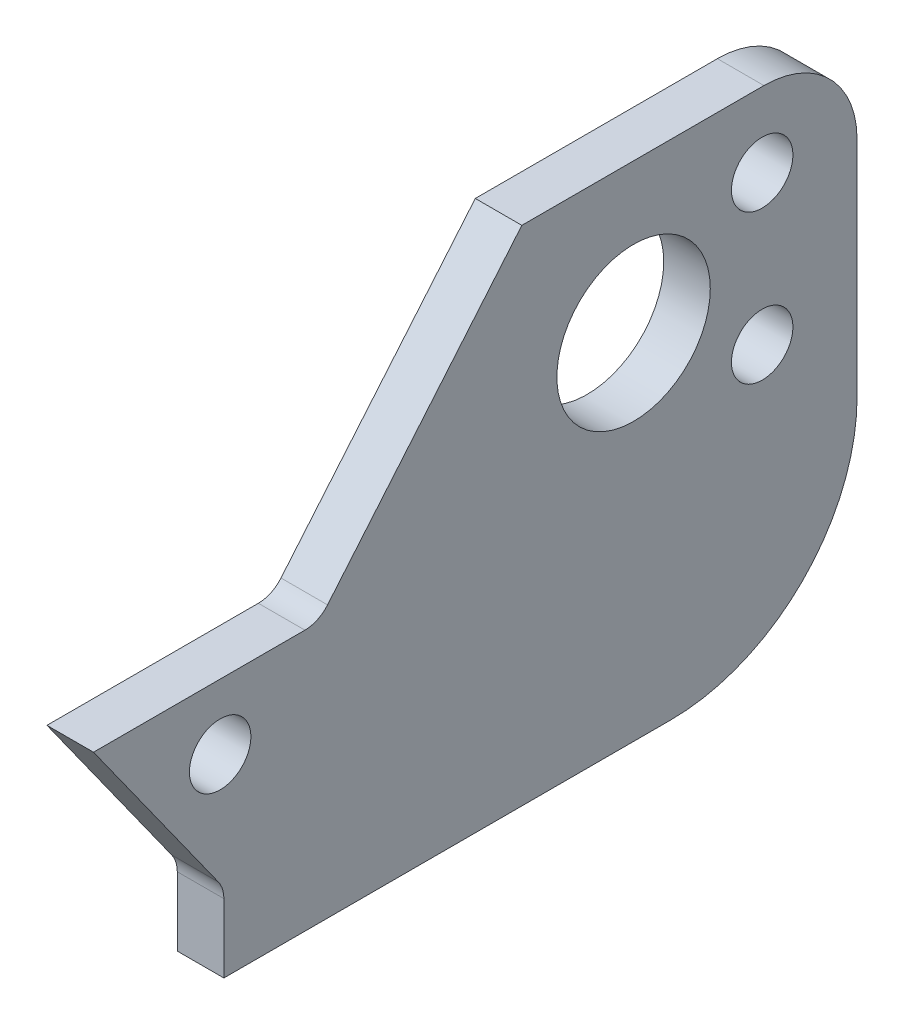
ISO-10303-21;
HEADER;
FILE_DESCRIPTION(('STEP AP214'),'2;1');
FILE_NAME('part.step','',(''),(''),'','','');
FILE_SCHEMA(('AUTOMOTIVE_DESIGN { 1 0 10303 214 1 1 1 1 }'));
ENDSEC;
DATA;
#1=APPLICATION_CONTEXT('core data for automotive mechanical design processes');
#2=APPLICATION_PROTOCOL_DEFINITION('international standard','automotive_design',2000,#1);
#3=PRODUCT_CONTEXT('',#1,'mechanical');
#4=PRODUCT('Part','Part','',(#3));
#5=PRODUCT_RELATED_PRODUCT_CATEGORY('part','',(#4));
#6=PRODUCT_DEFINITION_FORMATION('','',#4);
#7=PRODUCT_DEFINITION_CONTEXT('part definition',#1,'design');
#8=PRODUCT_DEFINITION('design','',#6,#7);
#9=PRODUCT_DEFINITION_SHAPE('','',#8);
#10=(LENGTH_UNIT() NAMED_UNIT(*) SI_UNIT(.MILLI.,.METRE.));
#11=(NAMED_UNIT(*) PLANE_ANGLE_UNIT() SI_UNIT($,.RADIAN.));
#12=(NAMED_UNIT(*) SI_UNIT($,.STERADIAN.) SOLID_ANGLE_UNIT());
#13=UNCERTAINTY_MEASURE_WITH_UNIT(LENGTH_MEASURE(1.E-05),#10,'distance_accuracy_value','');
#14=(GEOMETRIC_REPRESENTATION_CONTEXT(3) GLOBAL_UNCERTAINTY_ASSIGNED_CONTEXT((#13)) GLOBAL_UNIT_ASSIGNED_CONTEXT((#10,
#11,#12)) REPRESENTATION_CONTEXT('',''));
#15=CARTESIAN_POINT('',(0.,0.,0.));
#16=DIRECTION('',(0.,0.,1.));
#17=DIRECTION('',(1.,0.,0.));
#18=AXIS2_PLACEMENT_3D('',#15,#16,#17);
#19=CARTESIAN_POINT('',(9.,6.99999999999999,0.));
#20=DIRECTION('',(0.,1.,0.));
#21=DIRECTION('',(0.,0.,1.));
#22=AXIS2_PLACEMENT_3D('',#19,#20,#21);
#23=PLANE('',#22);
#24=DIRECTION('',(0.,0.,-1.));
#25=VECTOR('',#24,1.);
#26=CARTESIAN_POINT('',(-6.5,6.99999999999999,0.));
#27=LINE('',#26,#25);
#28=CARTESIAN_POINT('',(-6.5,7.,41.));
#29=VERTEX_POINT('',#28);
#30=CARTESIAN_POINT('',(-6.5,6.99999999999999,29.6485586126258));
#31=VERTEX_POINT('',#30);
#32=EDGE_CURVE('E159',#29,#31,#27,.T.);
#33=ORIENTED_EDGE('',*,*,#32,.T.);
#34=DIRECTION('',(-1.,0.,0.));
#35=VECTOR('',#34,1.);
#36=CARTESIAN_POINT('',(9.,6.99999999999999,29.6485586126258));
#37=LINE('',#36,#35);
#38=CARTESIAN_POINT('',(-9.,6.99999999999999,29.6485586126258));
#39=VERTEX_POINT('',#38);
#40=EDGE_CURVE('E232',#31,#39,#37,.T.);
#41=ORIENTED_EDGE('',*,*,#40,.T.);
#42=DIRECTION('',(0.,0.,-1.));
#43=VECTOR('',#42,1.);
#44=CARTESIAN_POINT('',(-9.,6.99999999999999,0.));
#45=LINE('',#44,#43);
#46=CARTESIAN_POINT('',(-9.,7.,41.));
#47=VERTEX_POINT('',#46);
#48=EDGE_CURVE('E162',#47,#39,#45,.T.);
#49=ORIENTED_EDGE('',*,*,#48,.F.);
#50=DIRECTION('',(-1.,0.,0.));
#51=VECTOR('',#50,1.);
#52=CARTESIAN_POINT('',(-6.5,7.,41.));
#53=LINE('',#52,#51);
#54=EDGE_CURVE('E147',#29,#47,#53,.T.);
#55=ORIENTED_EDGE('',*,*,#54,.F.);
#56=EDGE_LOOP('',(#33,#41,#49,#55));
#57=FACE_BOUND('',#56,.T.);
#58=ADVANCED_FACE('F64',(#57),#23,.T.);
#59=CARTESIAN_POINT('',(9.,-6.99999999999999,0.));
#60=DIRECTION('',(0.,1.,0.));
#61=DIRECTION('',(0.,0.,1.));
#62=AXIS2_PLACEMENT_3D('',#59,#60,#61);
#63=PLANE('',#62);
#64=DIRECTION('',(0.,0.,-1.));
#65=VECTOR('',#64,1.);
#66=CARTESIAN_POINT('',(-6.5,-6.99999999999999,0.));
#67=LINE('',#66,#65);
#68=CARTESIAN_POINT('',(-6.5,-7.,34.));
#69=VERTEX_POINT('',#68);
#70=CARTESIAN_POINT('',(-6.5,-7.,10.));
#71=VERTEX_POINT('',#70);
#72=EDGE_CURVE('E305',#69,#71,#67,.T.);
#73=ORIENTED_EDGE('',*,*,#72,.F.);
#74=DIRECTION('',(-1.,0.,0.));
#75=VECTOR('',#74,1.);
#76=CARTESIAN_POINT('',(-6.5,-7.00000000000001,34.));
#77=LINE('',#76,#75);
#78=CARTESIAN_POINT('',(-9.,-7.00000000000001,34.));
#79=VERTEX_POINT('',#78);
#80=EDGE_CURVE('E165',#69,#79,#77,.T.);
#81=ORIENTED_EDGE('',*,*,#80,.T.);
#82=DIRECTION('',(0.,0.,-1.));
#83=VECTOR('',#82,1.);
#84=CARTESIAN_POINT('',(-9.,-6.99999999999999,0.));
#85=LINE('',#84,#83);
#86=CARTESIAN_POINT('',(-9.,-7.,10.));
#87=VERTEX_POINT('',#86);
#88=EDGE_CURVE('E190',#79,#87,#85,.T.);
#89=ORIENTED_EDGE('',*,*,#88,.T.);
#90=DIRECTION('',(-1.,0.,0.));
#91=VECTOR('',#90,1.);
#92=CARTESIAN_POINT('',(-6.5,-7.,10.));
#93=LINE('',#92,#91);
#94=EDGE_CURVE('E225',#87,#71,#93,.F.);
#95=ORIENTED_EDGE('',*,*,#94,.T.);
#96=EDGE_LOOP('',(#73,#81,#89,#95));
#97=FACE_BOUND('',#96,.T.);
#98=ADVANCED_FACE('F271',(#97),#63,.F.);
#99=CARTESIAN_POINT('',(9.,20.,0.));
#100=DIRECTION('',(0.,1.,0.));
#101=DIRECTION('',(0.,0.,1.));
#102=AXIS2_PLACEMENT_3D('',#99,#100,#101);
#103=PLANE('',#102);
#104=DIRECTION('',(0.,0.,-1.));
#105=VECTOR('',#104,1.);
#106=CARTESIAN_POINT('',(-6.5,20.,0.));
#107=LINE('',#106,#105);
#108=CARTESIAN_POINT('',(-6.5,20.,18.));
#109=VERTEX_POINT('',#108);
#110=CARTESIAN_POINT('',(-6.5,20.,5.));
#111=VERTEX_POINT('',#110);
#112=EDGE_CURVE('E181',#109,#111,#107,.T.);
#113=ORIENTED_EDGE('',*,*,#112,.T.);
#114=DIRECTION('',(-1.,0.,0.));
#115=VECTOR('',#114,1.);
#116=CARTESIAN_POINT('',(9.,20.,5.));
#117=LINE('',#116,#115);
#118=CARTESIAN_POINT('',(-9.,20.,5.));
#119=VERTEX_POINT('',#118);
#120=EDGE_CURVE('E204',#111,#119,#117,.T.);
#121=ORIENTED_EDGE('',*,*,#120,.T.);
#122=DIRECTION('',(0.,0.,-1.));
#123=VECTOR('',#122,1.);
#124=CARTESIAN_POINT('',(-9.,20.,0.));
#125=LINE('',#124,#123);
#126=CARTESIAN_POINT('',(-9.,20.,18.));
#127=VERTEX_POINT('',#126);
#128=EDGE_CURVE('E173',#127,#119,#125,.T.);
#129=ORIENTED_EDGE('',*,*,#128,.F.);
#130=DIRECTION('',(-1.,0.,0.));
#131=VECTOR('',#130,1.);
#132=CARTESIAN_POINT('',(9.,20.,18.));
#133=LINE('',#132,#131);
#134=EDGE_CURVE('E197',#109,#127,#133,.T.);
#135=ORIENTED_EDGE('',*,*,#134,.F.);
#136=EDGE_LOOP('',(#113,#121,#129,#135));
#137=FACE_BOUND('',#136,.T.);
#138=ADVANCED_FACE('F277',(#137),#103,.T.);
#139=CARTESIAN_POINT('',(9.,17.1267880004407,20.4109111291244));
#140=DIRECTION('',(0.,-0.642787609686543,-0.766044443118975));
#141=DIRECTION('',(0.,0.766044443118975,-0.642787609686543));
#142=AXIS2_PLACEMENT_3D('',#139,#140,#141);
#143=PLANE('',#142);
#144=DIRECTION('',(0.,-0.766044443118975,0.642787609686543));
#145=VECTOR('',#144,1.);
#146=CARTESIAN_POINT('',(-9.,17.1267880004407,20.4109111291244));
#147=LINE('',#146,#145);
#148=CARTESIAN_POINT('',(-9.,7.5670746696226,28.4324630591744));
#149=VERTEX_POINT('',#148);
#150=EDGE_CURVE('E179',#127,#149,#147,.T.);
#151=ORIENTED_EDGE('',*,*,#150,.T.);
#152=DIRECTION('',(-1.,0.,0.));
#153=VECTOR('',#152,1.);
#154=CARTESIAN_POINT('',(9.,7.5670746696226,28.4324630591744));
#155=LINE('',#154,#153);
#156=CARTESIAN_POINT('',(-6.5,7.5670746696226,28.4324630591744));
#157=VERTEX_POINT('',#156);
#158=EDGE_CURVE('E235',#149,#157,#155,.F.);
#159=ORIENTED_EDGE('',*,*,#158,.T.);
#160=DIRECTION('',(0.,-0.766044443118975,0.642787609686543));
#161=VECTOR('',#160,1.);
#162=CARTESIAN_POINT('',(-6.5,17.1267880004407,20.4109111291244));
#163=LINE('',#162,#161);
#164=EDGE_CURVE('E174',#109,#157,#163,.T.);
#165=ORIENTED_EDGE('',*,*,#164,.F.);
#166=ORIENTED_EDGE('',*,*,#134,.T.);
#167=EDGE_LOOP('',(#151,#159,#165,#166));
#168=FACE_BOUND('',#167,.T.);
#169=ADVANCED_FACE('F255',(#168),#143,.F.);
#170=CARTESIAN_POINT('',(9.,0.,0.));
#171=DIRECTION('',(0.,0.,-1.));
#172=DIRECTION('',(0.,1.,0.));
#173=AXIS2_PLACEMENT_3D('',#170,#171,#172);
#174=PLANE('',#173);
#175=DIRECTION('',(0.,-1.,0.));
#176=VECTOR('',#175,1.);
#177=CARTESIAN_POINT('',(-6.5,0.,0.));
#178=LINE('',#177,#176);
#179=CARTESIAN_POINT('',(-6.5,15.,0.));
#180=VERTEX_POINT('',#179);
#181=CARTESIAN_POINT('',(-6.5,3.,0.));
#182=VERTEX_POINT('',#181);
#183=EDGE_CURVE('E200',#180,#182,#178,.T.);
#184=ORIENTED_EDGE('',*,*,#183,.T.);
#185=DIRECTION('',(-1.,0.,0.));
#186=VECTOR('',#185,1.);
#187=CARTESIAN_POINT('',(-9.,3.,0.));
#188=LINE('',#187,#186);
#189=CARTESIAN_POINT('',(-9.,3.,0.));
#190=VERTEX_POINT('',#189);
#191=EDGE_CURVE('E217',#182,#190,#188,.T.);
#192=ORIENTED_EDGE('',*,*,#191,.T.);
#193=DIRECTION('',(0.,-1.,0.));
#194=VECTOR('',#193,1.);
#195=CARTESIAN_POINT('',(-9.,0.,0.));
#196=LINE('',#195,#194);
#197=CARTESIAN_POINT('',(-9.,15.,0.));
#198=VERTEX_POINT('',#197);
#199=EDGE_CURVE('E193',#198,#190,#196,.T.);
#200=ORIENTED_EDGE('',*,*,#199,.F.);
#201=DIRECTION('',(-1.,0.,0.));
#202=VECTOR('',#201,1.);
#203=CARTESIAN_POINT('',(9.,15.,0.));
#204=LINE('',#203,#202);
#205=EDGE_CURVE('E211',#198,#180,#204,.F.);
#206=ORIENTED_EDGE('',*,*,#205,.T.);
#207=EDGE_LOOP('',(#184,#192,#200,#206));
#208=FACE_BOUND('',#207,.T.);
#209=ADVANCED_FACE('F283',(#208),#174,.T.);
#210=CARTESIAN_POINT('',(-9.,0.,0.));
#211=DIRECTION('',(1.,0.,0.));
#212=DIRECTION('',(0.,0.,-1.));
#213=AXIS2_PLACEMENT_3D('',#210,#211,#212);
#214=PLANE('',#213);
#215=CARTESIAN_POINT('',(-9.,3.5,34.1988373664787));
#216=DIRECTION('',(-1.,0.,0.));
#217=DIRECTION('',(0.,0.,1.));
#218=AXIS2_PLACEMENT_3D('',#215,#216,#217);
#219=CIRCLE('',#218,1.65);
#220=CARTESIAN_POINT('',(-9.,3.5,35.8488373664787));
#221=VERTEX_POINT('',#220);
#222=EDGE_CURVE('E349',#221,#221,#219,.T.);
#223=ORIENTED_EDGE('',*,*,#222,.F.);
#224=EDGE_LOOP('',(#223));
#225=FACE_BOUND('',#224,.T.);
#226=CARTESIAN_POINT('',(-9.,8.,5.0949004351856));
#227=DIRECTION('',(-1.,0.,0.));
#228=DIRECTION('',(0.,0.,1.));
#229=AXIS2_PLACEMENT_3D('',#226,#227,#228);
#230=CIRCLE('',#229,1.65);
#231=CARTESIAN_POINT('',(-9.,8.,6.7449004351856));
#232=VERTEX_POINT('',#231);
#233=EDGE_CURVE('E342',#232,#232,#230,.F.);
#234=ORIENTED_EDGE('',*,*,#233,.T.);
#235=EDGE_LOOP('',(#234));
#236=FACE_BOUND('',#235,.T.);
#237=CARTESIAN_POINT('',(-9.,16.,5.0949004351856));
#238=DIRECTION('',(-1.,0.,0.));
#239=DIRECTION('',(0.,0.,1.));
#240=AXIS2_PLACEMENT_3D('',#237,#238,#239);
#241=CIRCLE('',#240,1.65);
#242=CARTESIAN_POINT('',(-9.,16.,6.7449004351856));
#243=VERTEX_POINT('',#242);
#244=EDGE_CURVE('E333',#243,#243,#241,.F.);
#245=ORIENTED_EDGE('',*,*,#244,.T.);
#246=EDGE_LOOP('',(#245));
#247=FACE_BOUND('',#246,.T.);
#248=CARTESIAN_POINT('',(-9.,12.,12.));
#249=DIRECTION('',(1.,0.,0.));
#250=DIRECTION('',(0.,0.,-1.));
#251=AXIS2_PLACEMENT_3D('',#248,#249,#250);
#252=CIRCLE('',#251,4.11875);
#253=CARTESIAN_POINT('',(-9.,12.,7.88125));
#254=VERTEX_POINT('',#253);
#255=EDGE_CURVE('E313',#254,#254,#252,.T.);
#256=ORIENTED_EDGE('',*,*,#255,.T.);
#257=EDGE_LOOP('',(#256));
#258=FACE_BOUND('',#257,.T.);
#259=DIRECTION('',(0.,-1.,0.));
#260=VECTOR('',#259,1.);
#261=CARTESIAN_POINT('',(-9.,-2.79999999999999,34.));
#262=LINE('',#261,#260);
#263=CARTESIAN_POINT('',(-9.,-3.30873827228603,34.));
#264=VERTEX_POINT('',#263);
#265=EDGE_CURVE('E153',#264,#79,#262,.T.);
#266=ORIENTED_EDGE('',*,*,#265,.F.);
#267=CARTESIAN_POINT('',(-9.,-3.30873827228603,35.5875));
#268=DIRECTION('',(1.,0.,0.));
#269=DIRECTION('',(0.,0.,-1.));
#270=AXIS2_PLACEMENT_3D('',#267,#268,#269);
#271=CIRCLE('',#270,1.5875);
#272=CARTESIAN_POINT('',(-9.,-2.38602263975696,34.2956981144593));
#273=VERTEX_POINT('',#272);
#274=EDGE_CURVE('E73',#264,#273,#271,.T.);
#275=ORIENTED_EDGE('',*,*,#274,.T.);
#276=DIRECTION('',(0.,-0.813733471206735,-0.581238193719097));
#277=VECTOR('',#276,1.);
#278=CARTESIAN_POINT('',(-9.,7.,41.));
#279=LINE('',#278,#277);
#280=EDGE_CURVE('E327',#47,#273,#279,.T.);
#281=ORIENTED_EDGE('',*,*,#280,.F.);
#282=ORIENTED_EDGE('',*,*,#48,.T.);
#283=CARTESIAN_POINT('',(-9.,8.5875,29.6485586126258));
#284=DIRECTION('',(1.,0.,0.));
#285=DIRECTION('',(0.,0.,-1.));
#286=AXIS2_PLACEMENT_3D('',#283,#284,#285);
#287=CIRCLE('',#286,1.5875);
#288=EDGE_CURVE('E244',#39,#149,#287,.T.);
#289=ORIENTED_EDGE('',*,*,#288,.T.);
#290=ORIENTED_EDGE('',*,*,#150,.F.);
#291=ORIENTED_EDGE('',*,*,#128,.T.);
#292=CARTESIAN_POINT('',(-9.,15.,5.));
#293=DIRECTION('',(1.,0.,0.));
#294=DIRECTION('',(0.,0.,-1.));
#295=AXIS2_PLACEMENT_3D('',#292,#293,#294);
#296=CIRCLE('',#295,5.);
#297=EDGE_CURVE('E208',#119,#198,#296,.F.);
#298=ORIENTED_EDGE('',*,*,#297,.T.);
#299=ORIENTED_EDGE('',*,*,#199,.T.);
#300=CARTESIAN_POINT('',(-9.,3.,10.));
#301=DIRECTION('',(1.,0.,0.));
#302=DIRECTION('',(0.,0.,-1.));
#303=AXIS2_PLACEMENT_3D('',#300,#301,#302);
#304=CIRCLE('',#303,10.);
#305=EDGE_CURVE('E221',#190,#87,#304,.F.);
#306=ORIENTED_EDGE('',*,*,#305,.T.);
#307=ORIENTED_EDGE('',*,*,#88,.F.);
#308=EDGE_LOOP('',(#266,#275,#281,#282,#289,#290,#291,#298,#299,#306,#307));
#309=FACE_BOUND('',#308,.T.);
#310=ADVANCED_FACE('F250',(#225,#236,#247,#258,#309),#214,.F.);
#311=CARTESIAN_POINT('',(-6.5,0.,0.));
#312=DIRECTION('',(1.,0.,0.));
#313=DIRECTION('',(0.,0.,-1.));
#314=AXIS2_PLACEMENT_3D('',#311,#312,#313);
#315=PLANE('',#314);
#316=CARTESIAN_POINT('',(-6.5,3.5,34.1988373664787));
#317=DIRECTION('',(-1.,0.,0.));
#318=DIRECTION('',(0.,0.,1.));
#319=AXIS2_PLACEMENT_3D('',#316,#317,#318);
#320=CIRCLE('',#319,1.65);
#321=CARTESIAN_POINT('',(-6.5,3.5,35.8488373664787));
#322=VERTEX_POINT('',#321);
#323=EDGE_CURVE('E338',#322,#322,#320,.T.);
#324=ORIENTED_EDGE('',*,*,#323,.T.);
#325=EDGE_LOOP('',(#324));
#326=FACE_BOUND('',#325,.T.);
#327=CARTESIAN_POINT('',(-6.5,8.,5.0949004351856));
#328=DIRECTION('',(-1.,0.,0.));
#329=DIRECTION('',(0.,0.,1.));
#330=AXIS2_PLACEMENT_3D('',#327,#328,#329);
#331=CIRCLE('',#330,1.65);
#332=CARTESIAN_POINT('',(-6.5,8.,6.7449004351856));
#333=VERTEX_POINT('',#332);
#334=EDGE_CURVE('E330',#333,#333,#331,.F.);
#335=ORIENTED_EDGE('',*,*,#334,.F.);
#336=EDGE_LOOP('',(#335));
#337=FACE_BOUND('',#336,.T.);
#338=CARTESIAN_POINT('',(-6.5,16.,5.0949004351856));
#339=DIRECTION('',(-1.,0.,0.));
#340=DIRECTION('',(0.,0.,1.));
#341=AXIS2_PLACEMENT_3D('',#338,#339,#340);
#342=CIRCLE('',#341,1.65);
#343=CARTESIAN_POINT('',(-6.5,16.,6.7449004351856));
#344=VERTEX_POINT('',#343);
#345=EDGE_CURVE('E337',#344,#344,#342,.F.);
#346=ORIENTED_EDGE('',*,*,#345,.F.);
#347=EDGE_LOOP('',(#346));
#348=FACE_BOUND('',#347,.T.);
#349=DIRECTION('',(0.,-0.813733471206735,-0.581238193719097));
#350=VECTOR('',#349,1.);
#351=CARTESIAN_POINT('',(-6.5,7.,41.));
#352=LINE('',#351,#350);
#353=CARTESIAN_POINT('',(-6.5,-2.38602263975696,34.2956981144593));
#354=VERTEX_POINT('',#353);
#355=EDGE_CURVE('E144',#29,#354,#352,.T.);
#356=ORIENTED_EDGE('',*,*,#355,.T.);
#357=CARTESIAN_POINT('',(-6.5,-3.30873827228603,35.5875));
#358=DIRECTION('',(1.,0.,0.));
#359=DIRECTION('',(0.,0.,-1.));
#360=AXIS2_PLACEMENT_3D('',#357,#358,#359);
#361=CIRCLE('',#360,1.5875);
#362=CARTESIAN_POINT('',(-6.5,-3.30873827228603,34.));
#363=VERTEX_POINT('',#362);
#364=EDGE_CURVE('E12',#354,#363,#361,.F.);
#365=ORIENTED_EDGE('',*,*,#364,.T.);
#366=DIRECTION('',(0.,-1.,0.));
#367=VECTOR('',#366,1.);
#368=CARTESIAN_POINT('',(-6.5,-2.79999999999999,34.));
#369=LINE('',#368,#367);
#370=EDGE_CURVE('E152',#363,#69,#369,.T.);
#371=ORIENTED_EDGE('',*,*,#370,.T.);
#372=ORIENTED_EDGE('',*,*,#72,.T.);
#373=CARTESIAN_POINT('',(-6.5,3.,10.));
#374=DIRECTION('',(1.,0.,0.));
#375=DIRECTION('',(0.,0.,-1.));
#376=AXIS2_PLACEMENT_3D('',#373,#374,#375);
#377=CIRCLE('',#376,10.);
#378=EDGE_CURVE('E229',#71,#182,#377,.T.);
#379=ORIENTED_EDGE('',*,*,#378,.T.);
#380=ORIENTED_EDGE('',*,*,#183,.F.);
#381=CARTESIAN_POINT('',(-6.5,15.,5.));
#382=DIRECTION('',(1.,0.,0.));
#383=DIRECTION('',(0.,0.,-1.));
#384=AXIS2_PLACEMENT_3D('',#381,#382,#383);
#385=CIRCLE('',#384,5.);
#386=EDGE_CURVE('E214',#180,#111,#385,.T.);
#387=ORIENTED_EDGE('',*,*,#386,.T.);
#388=ORIENTED_EDGE('',*,*,#112,.F.);
#389=ORIENTED_EDGE('',*,*,#164,.T.);
#390=CARTESIAN_POINT('',(-6.5,8.5875,29.6485586126258));
#391=DIRECTION('',(1.,0.,0.));
#392=DIRECTION('',(0.,0.,-1.));
#393=AXIS2_PLACEMENT_3D('',#390,#391,#392);
#394=CIRCLE('',#393,1.5875);
#395=EDGE_CURVE('E171',#157,#31,#394,.F.);
#396=ORIENTED_EDGE('',*,*,#395,.T.);
#397=ORIENTED_EDGE('',*,*,#32,.F.);
#398=EDGE_LOOP('',(#356,#365,#371,#372,#379,#380,#387,#388,#389,#396,#397));
#399=FACE_BOUND('',#398,.T.);
#400=CARTESIAN_POINT('',(-6.5,12.,12.));
#401=DIRECTION('',(1.,0.,0.));
#402=DIRECTION('',(0.,0.,-1.));
#403=AXIS2_PLACEMENT_3D('',#400,#401,#402);
#404=CIRCLE('',#403,4.11875);
#405=CARTESIAN_POINT('',(-6.5,12.,7.88125));
#406=VERTEX_POINT('',#405);
#407=EDGE_CURVE('E164',#406,#406,#404,.T.);
#408=ORIENTED_EDGE('',*,*,#407,.F.);
#409=EDGE_LOOP('',(#408));
#410=FACE_BOUND('',#409,.T.);
#411=ADVANCED_FACE('F167',(#326,#337,#348,#399,#410),#315,.T.);
#412=CARTESIAN_POINT('',(-12.5,12.,12.));
#413=DIRECTION('',(1.,0.,0.));
#414=DIRECTION('',(0.,0.,-1.));
#415=AXIS2_PLACEMENT_3D('',#412,#413,#414);
#416=CYLINDRICAL_SURFACE('',#415,4.11875);
#417=ORIENTED_EDGE('',*,*,#407,.T.);
#418=EDGE_LOOP('',(#417));
#419=FACE_BOUND('',#418,.T.);
#420=ORIENTED_EDGE('',*,*,#255,.F.);
#421=EDGE_LOOP('',(#420));
#422=FACE_BOUND('',#421,.T.);
#423=ADVANCED_FACE('F290',(#419,#422),#416,.F.);
#424=CARTESIAN_POINT('',(9.,15.,5.));
#425=DIRECTION('',(-1.,0.,0.));
#426=DIRECTION('',(0.,0.,1.));
#427=AXIS2_PLACEMENT_3D('',#424,#425,#426);
#428=CYLINDRICAL_SURFACE('',#427,5.);
#429=ORIENTED_EDGE('',*,*,#386,.F.);
#430=ORIENTED_EDGE('',*,*,#205,.F.);
#431=ORIENTED_EDGE('',*,*,#297,.F.);
#432=ORIENTED_EDGE('',*,*,#120,.F.);
#433=EDGE_LOOP('',(#429,#430,#431,#432));
#434=FACE_BOUND('',#433,.T.);
#435=ADVANCED_FACE('F287',(#434),#428,.T.);
#436=CARTESIAN_POINT('',(9.,3.,10.));
#437=DIRECTION('',(1.,0.,0.));
#438=DIRECTION('',(0.,0.,-1.));
#439=AXIS2_PLACEMENT_3D('',#436,#437,#438);
#440=CYLINDRICAL_SURFACE('',#439,10.);
#441=ORIENTED_EDGE('',*,*,#378,.F.);
#442=ORIENTED_EDGE('',*,*,#94,.F.);
#443=ORIENTED_EDGE('',*,*,#305,.F.);
#444=ORIENTED_EDGE('',*,*,#191,.F.);
#445=EDGE_LOOP('',(#441,#442,#443,#444));
#446=FACE_BOUND('',#445,.T.);
#447=ADVANCED_FACE('F289',(#446),#440,.T.);
#448=CARTESIAN_POINT('',(-6.5,7.,41.));
#449=DIRECTION('',(0.,0.581238193719097,-0.813733471206735));
#450=DIRECTION('',(0.,0.813733471206735,0.581238193719097));
#451=AXIS2_PLACEMENT_3D('',#448,#449,#450);
#452=PLANE('',#451);
#453=ORIENTED_EDGE('',*,*,#280,.T.);
#454=DIRECTION('',(-1.,0.,0.));
#455=VECTOR('',#454,1.);
#456=CARTESIAN_POINT('',(-6.5,-2.38602263975696,34.2956981144593));
#457=LINE('',#456,#455);
#458=EDGE_CURVE('E80',#273,#354,#457,.F.);
#459=ORIENTED_EDGE('',*,*,#458,.T.);
#460=ORIENTED_EDGE('',*,*,#355,.F.);
#461=ORIENTED_EDGE('',*,*,#54,.T.);
#462=EDGE_LOOP('',(#453,#459,#460,#461));
#463=FACE_BOUND('',#462,.T.);
#464=ADVANCED_FACE('F146',(#463),#452,.F.);
#465=CARTESIAN_POINT('',(-6.5,-2.79999999999999,34.));
#466=DIRECTION('',(0.,0.,-1.));
#467=DIRECTION('',(-1.,0.,0.));
#468=AXIS2_PLACEMENT_3D('',#465,#466,#467);
#469=PLANE('',#468);
#470=ORIENTED_EDGE('',*,*,#370,.F.);
#471=DIRECTION('',(-1.,0.,0.));
#472=VECTOR('',#471,1.);
#473=CARTESIAN_POINT('',(-9.,-3.30873827228603,34.));
#474=LINE('',#473,#472);
#475=EDGE_CURVE('E238',#363,#264,#474,.T.);
#476=ORIENTED_EDGE('',*,*,#475,.T.);
#477=ORIENTED_EDGE('',*,*,#265,.T.);
#478=ORIENTED_EDGE('',*,*,#80,.F.);
#479=EDGE_LOOP('',(#470,#476,#477,#478));
#480=FACE_BOUND('',#479,.T.);
#481=ADVANCED_FACE('F260',(#480),#469,.F.);
#482=CARTESIAN_POINT('',(9.,8.5875,29.6485586126258));
#483=DIRECTION('',(-1.,0.,0.));
#484=DIRECTION('',(0.,0.,1.));
#485=AXIS2_PLACEMENT_3D('',#482,#483,#484);
#486=CYLINDRICAL_SURFACE('',#485,1.5875);
#487=ORIENTED_EDGE('',*,*,#395,.F.);
#488=ORIENTED_EDGE('',*,*,#158,.F.);
#489=ORIENTED_EDGE('',*,*,#288,.F.);
#490=ORIENTED_EDGE('',*,*,#40,.F.);
#491=EDGE_LOOP('',(#487,#488,#489,#490));
#492=FACE_BOUND('',#491,.T.);
#493=ADVANCED_FACE('F258',(#492),#486,.F.);
#494=CARTESIAN_POINT('',(-6.5,-3.30873827228603,35.5875));
#495=DIRECTION('',(1.,0.,0.));
#496=DIRECTION('',(0.,0.,-1.));
#497=AXIS2_PLACEMENT_3D('',#494,#495,#496);
#498=CYLINDRICAL_SURFACE('',#497,1.5875);
#499=ORIENTED_EDGE('',*,*,#364,.F.);
#500=ORIENTED_EDGE('',*,*,#458,.F.);
#501=ORIENTED_EDGE('',*,*,#274,.F.);
#502=ORIENTED_EDGE('',*,*,#475,.F.);
#503=EDGE_LOOP('',(#499,#500,#501,#502));
#504=FACE_BOUND('',#503,.T.);
#505=ADVANCED_FACE('F66',(#504),#498,.F.);
#506=CARTESIAN_POINT('',(-6.5,16.,5.0949004351856));
#507=DIRECTION('',(-1.,0.,0.));
#508=DIRECTION('',(0.,0.,1.));
#509=AXIS2_PLACEMENT_3D('',#506,#507,#508);
#510=CYLINDRICAL_SURFACE('',#509,1.65);
#511=ORIENTED_EDGE('',*,*,#345,.T.);
#512=EDGE_LOOP('',(#511));
#513=FACE_BOUND('',#512,.T.);
#514=ORIENTED_EDGE('',*,*,#244,.F.);
#515=EDGE_LOOP('',(#514));
#516=FACE_BOUND('',#515,.T.);
#517=ADVANCED_FACE('F265',(#513,#516),#510,.F.);
#518=CARTESIAN_POINT('',(-6.5,8.,5.0949004351856));
#519=DIRECTION('',(-1.,0.,0.));
#520=DIRECTION('',(0.,0.,1.));
#521=AXIS2_PLACEMENT_3D('',#518,#519,#520);
#522=CYLINDRICAL_SURFACE('',#521,1.65);
#523=ORIENTED_EDGE('',*,*,#334,.T.);
#524=EDGE_LOOP('',(#523));
#525=FACE_BOUND('',#524,.T.);
#526=ORIENTED_EDGE('',*,*,#233,.F.);
#527=EDGE_LOOP('',(#526));
#528=FACE_BOUND('',#527,.T.);
#529=ADVANCED_FACE('F362',(#525,#528),#522,.F.);
#530=CARTESIAN_POINT('',(-6.5,3.5,34.1988373664787));
#531=DIRECTION('',(-1.,0.,0.));
#532=DIRECTION('',(0.,0.,1.));
#533=AXIS2_PLACEMENT_3D('',#530,#531,#532);
#534=CYLINDRICAL_SURFACE('',#533,1.65);
#535=ORIENTED_EDGE('',*,*,#323,.F.);
#536=EDGE_LOOP('',(#535));
#537=FACE_BOUND('',#536,.T.);
#538=ORIENTED_EDGE('',*,*,#222,.T.);
#539=EDGE_LOOP('',(#538));
#540=FACE_BOUND('',#539,.T.);
#541=ADVANCED_FACE('F359',(#537,#540),#534,.F.);
#542=CLOSED_SHELL('',(#58,#98,#138,#169,#209,#310,#411,#423,#435,#447,#464,#481,#493,#505,#517,
#529,#541));
#543=MANIFOLD_SOLID_BREP('B2',#542);
#544=ADVANCED_BREP_SHAPE_REPRESENTATION('',(#18,#543),#14);
#545=SHAPE_DEFINITION_REPRESENTATION(#9,#544);
ENDSEC;
END-ISO-10303-21;
